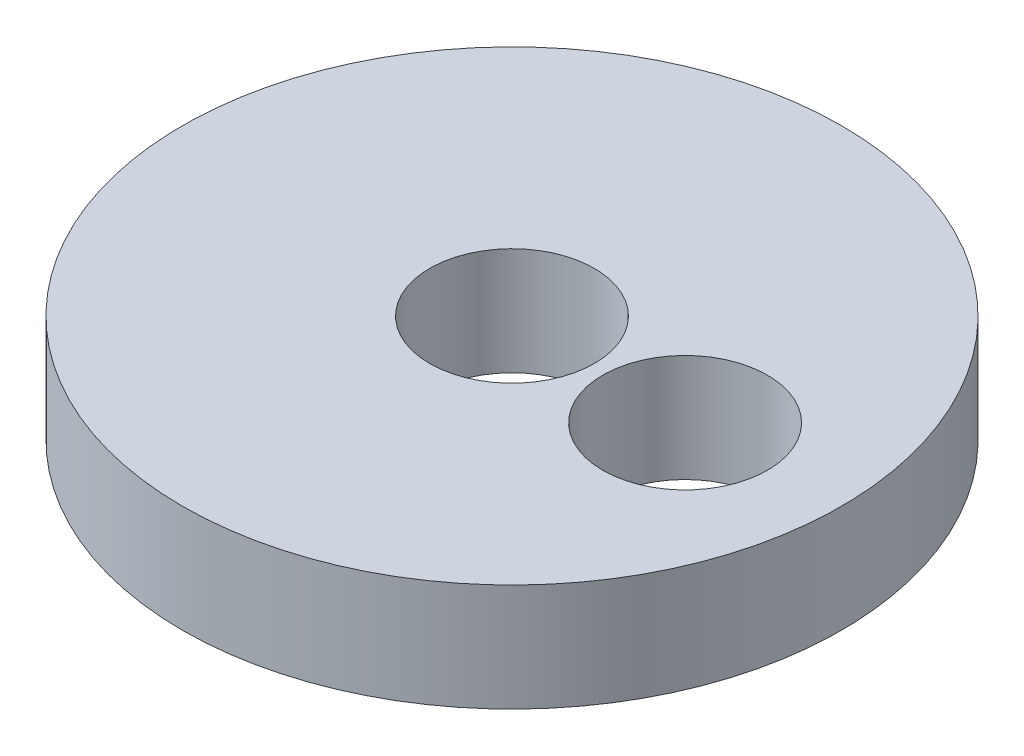
ISO-10303-21;
HEADER;
FILE_DESCRIPTION(('STEP AP214'),'2;1');
FILE_NAME('part.step','',(''),(''),'','','');
FILE_SCHEMA(('AUTOMOTIVE_DESIGN { 1 0 10303 214 1 1 1 1 }'));
ENDSEC;
DATA;
#1=APPLICATION_CONTEXT('core data for automotive mechanical design processes');
#2=APPLICATION_PROTOCOL_DEFINITION('international standard','automotive_design',2000,#1);
#3=PRODUCT_CONTEXT('',#1,'mechanical');
#4=PRODUCT('Part','Part','',(#3));
#5=PRODUCT_RELATED_PRODUCT_CATEGORY('part','',(#4));
#6=PRODUCT_DEFINITION_FORMATION('','',#4);
#7=PRODUCT_DEFINITION_CONTEXT('part definition',#1,'design');
#8=PRODUCT_DEFINITION('design','',#6,#7);
#9=PRODUCT_DEFINITION_SHAPE('','',#8);
#10=(LENGTH_UNIT() NAMED_UNIT(*) SI_UNIT(.MILLI.,.METRE.));
#11=(NAMED_UNIT(*) PLANE_ANGLE_UNIT() SI_UNIT($,.RADIAN.));
#12=(NAMED_UNIT(*) SI_UNIT($,.STERADIAN.) SOLID_ANGLE_UNIT());
#13=UNCERTAINTY_MEASURE_WITH_UNIT(LENGTH_MEASURE(1.E-05),#10,'distance_accuracy_value','');
#14=(GEOMETRIC_REPRESENTATION_CONTEXT(3) GLOBAL_UNCERTAINTY_ASSIGNED_CONTEXT((#13)) GLOBAL_UNIT_ASSIGNED_CONTEXT((#10,
#11,#12)) REPRESENTATION_CONTEXT('',''));
#15=CARTESIAN_POINT('',(0.,0.,0.));
#16=DIRECTION('',(0.,0.,1.));
#17=DIRECTION('',(1.,0.,0.));
#18=AXIS2_PLACEMENT_3D('',#15,#16,#17);
#19=CARTESIAN_POINT('',(0.,3.,0.));
#20=DIRECTION('',(0.,1.,0.));
#21=DIRECTION('',(0.,0.,1.));
#22=AXIS2_PLACEMENT_3D('',#19,#20,#21);
#23=PLANE('',#22);
#24=CARTESIAN_POINT('',(0.,3.,0.));
#25=DIRECTION('',(0.,1.,0.));
#26=DIRECTION('',(0.,0.,1.));
#27=AXIS2_PLACEMENT_3D('',#24,#25,#26);
#28=CIRCLE('',#27,2.3);
#29=CARTESIAN_POINT('',(0.,3.,2.3));
#30=VERTEX_POINT('',#29);
#31=EDGE_CURVE('E58',#30,#30,#28,.T.);
#32=ORIENTED_EDGE('',*,*,#31,.F.);
#33=EDGE_LOOP('',(#32));
#34=FACE_BOUND('',#33,.T.);
#35=CARTESIAN_POINT('',(0.,3.,0.));
#36=DIRECTION('',(0.,1.,0.));
#37=DIRECTION('',(0.,0.,1.));
#38=AXIS2_PLACEMENT_3D('',#35,#36,#37);
#39=CIRCLE('',#38,9.2);
#40=CARTESIAN_POINT('',(0.,3.,9.2));
#41=VERTEX_POINT('',#40);
#42=EDGE_CURVE('E11',#41,#41,#39,.T.);
#43=ORIENTED_EDGE('',*,*,#42,.T.);
#44=EDGE_LOOP('',(#43));
#45=FACE_BOUND('',#44,.T.);
#46=CARTESIAN_POINT('',(4.99728198946741,3.,0.16484149278824));
#47=DIRECTION('',(0.,1.,0.));
#48=DIRECTION('',(0.,0.,1.));
#49=AXIS2_PLACEMENT_3D('',#46,#47,#48);
#50=CIRCLE('',#49,2.3);
#51=CARTESIAN_POINT('',(4.99728198946741,3.,2.46484149278824));
#52=VERTEX_POINT('',#51);
#53=EDGE_CURVE('E69',#52,#52,#50,.T.);
#54=ORIENTED_EDGE('',*,*,#53,.F.);
#55=EDGE_LOOP('',(#54));
#56=FACE_BOUND('',#55,.T.);
#57=ADVANCED_FACE('F44',(#34,#45,#56),#23,.T.);
#58=CARTESIAN_POINT('',(0.,0.,0.));
#59=DIRECTION('',(0.,1.,0.));
#60=DIRECTION('',(0.,0.,1.));
#61=AXIS2_PLACEMENT_3D('',#58,#59,#60);
#62=PLANE('',#61);
#63=CARTESIAN_POINT('',(0.,0.,0.));
#64=DIRECTION('',(0.,1.,0.));
#65=DIRECTION('',(0.,0.,1.));
#66=AXIS2_PLACEMENT_3D('',#63,#64,#65);
#67=CIRCLE('',#66,9.2);
#68=CARTESIAN_POINT('',(0.,0.,9.2));
#69=VERTEX_POINT('',#68);
#70=EDGE_CURVE('E48',#69,#69,#67,.T.);
#71=ORIENTED_EDGE('',*,*,#70,.F.);
#72=EDGE_LOOP('',(#71));
#73=FACE_BOUND('',#72,.T.);
#74=CARTESIAN_POINT('',(0.,0.,0.));
#75=DIRECTION('',(0.,1.,0.));
#76=DIRECTION('',(0.,0.,1.));
#77=AXIS2_PLACEMENT_3D('',#74,#75,#76);
#78=CIRCLE('',#77,2.3);
#79=CARTESIAN_POINT('',(0.,0.,2.3));
#80=VERTEX_POINT('',#79);
#81=EDGE_CURVE('E61',#80,#80,#78,.T.);
#82=ORIENTED_EDGE('',*,*,#81,.T.);
#83=EDGE_LOOP('',(#82));
#84=FACE_BOUND('',#83,.T.);
#85=CARTESIAN_POINT('',(4.99728198946741,0.,0.16484149278824));
#86=DIRECTION('',(0.,1.,0.));
#87=DIRECTION('',(0.,0.,1.));
#88=AXIS2_PLACEMENT_3D('',#85,#86,#87);
#89=CIRCLE('',#88,2.3);
#90=CARTESIAN_POINT('',(4.99728198946741,0.,2.46484149278824));
#91=VERTEX_POINT('',#90);
#92=EDGE_CURVE('E67',#91,#91,#89,.T.);
#93=ORIENTED_EDGE('',*,*,#92,.T.);
#94=EDGE_LOOP('',(#93));
#95=FACE_BOUND('',#94,.T.);
#96=ADVANCED_FACE('F77',(#73,#84,#95),#62,.F.);
#97=CARTESIAN_POINT('',(0.,3.,0.));
#98=DIRECTION('',(0.,-1.,0.));
#99=DIRECTION('',(0.,0.,-1.));
#100=AXIS2_PLACEMENT_3D('',#97,#98,#99);
#101=CYLINDRICAL_SURFACE('',#100,9.2);
#102=ORIENTED_EDGE('',*,*,#42,.F.);
#103=EDGE_LOOP('',(#102));
#104=FACE_BOUND('',#103,.T.);
#105=ORIENTED_EDGE('',*,*,#70,.T.);
#106=EDGE_LOOP('',(#105));
#107=FACE_BOUND('',#106,.T.);
#108=ADVANCED_FACE('F46',(#104,#107),#101,.T.);
#109=CARTESIAN_POINT('',(0.,3.,0.));
#110=DIRECTION('',(0.,-1.,0.));
#111=DIRECTION('',(0.,0.,-1.));
#112=AXIS2_PLACEMENT_3D('',#109,#110,#111);
#113=CYLINDRICAL_SURFACE('',#112,2.3);
#114=ORIENTED_EDGE('',*,*,#31,.T.);
#115=EDGE_LOOP('',(#114));
#116=FACE_BOUND('',#115,.T.);
#117=ORIENTED_EDGE('',*,*,#81,.F.);
#118=EDGE_LOOP('',(#117));
#119=FACE_BOUND('',#118,.T.);
#120=ADVANCED_FACE('F80',(#116,#119),#113,.F.);
#121=CARTESIAN_POINT('',(4.99728198946741,3.,0.16484149278824));
#122=DIRECTION('',(0.,-1.,0.));
#123=DIRECTION('',(0.,0.,-1.));
#124=AXIS2_PLACEMENT_3D('',#121,#122,#123);
#125=CYLINDRICAL_SURFACE('',#124,2.3);
#126=ORIENTED_EDGE('',*,*,#53,.T.);
#127=EDGE_LOOP('',(#126));
#128=FACE_BOUND('',#127,.T.);
#129=ORIENTED_EDGE('',*,*,#92,.F.);
#130=EDGE_LOOP('',(#129));
#131=FACE_BOUND('',#130,.T.);
#132=ADVANCED_FACE('F82',(#128,#131),#125,.F.);
#133=CLOSED_SHELL('',(#57,#96,#108,#120,#132));
#134=MANIFOLD_SOLID_BREP('B2',#133);
#135=ADVANCED_BREP_SHAPE_REPRESENTATION('',(#18,#134),#14);
#136=SHAPE_DEFINITION_REPRESENTATION(#9,#135);
ENDSEC;
END-ISO-10303-21;
